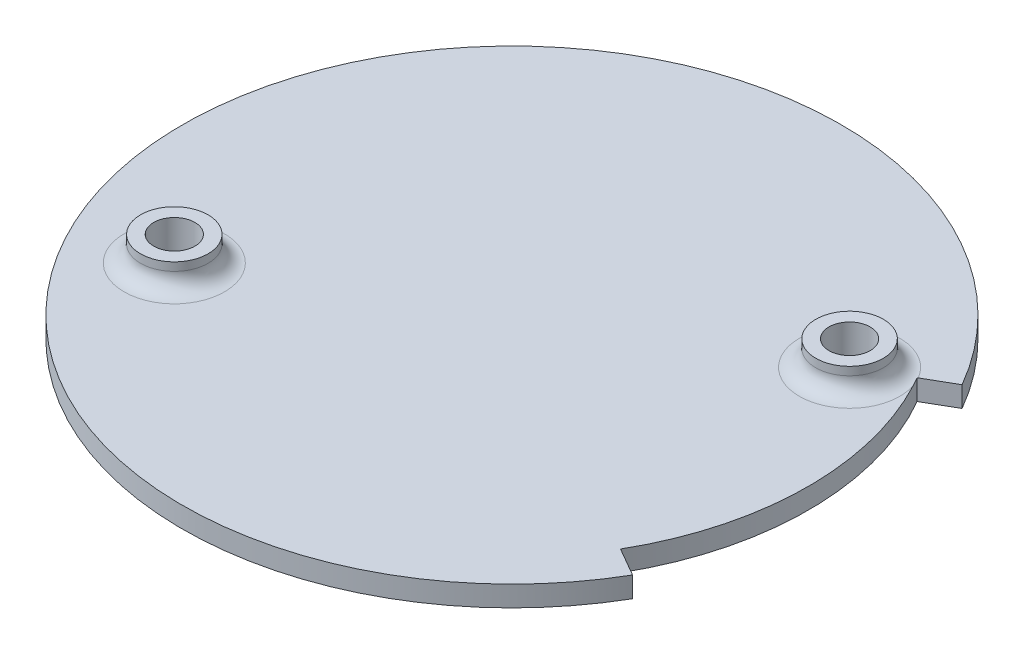
ISO-10303-21;
HEADER;
FILE_DESCRIPTION(('STEP AP214'),'2;1');
FILE_NAME('part.step','',(''),(''),'','','');
FILE_SCHEMA(('AUTOMOTIVE_DESIGN { 1 0 10303 214 1 1 1 1 }'));
ENDSEC;
DATA;
#1=APPLICATION_CONTEXT('core data for automotive mechanical design processes');
#2=APPLICATION_PROTOCOL_DEFINITION('international standard','automotive_design',2000,#1);
#3=PRODUCT_CONTEXT('',#1,'mechanical');
#4=PRODUCT('Part','Part','',(#3));
#5=PRODUCT_RELATED_PRODUCT_CATEGORY('part','',(#4));
#6=PRODUCT_DEFINITION_FORMATION('','',#4);
#7=PRODUCT_DEFINITION_CONTEXT('part definition',#1,'design');
#8=PRODUCT_DEFINITION('design','',#6,#7);
#9=PRODUCT_DEFINITION_SHAPE('','',#8);
#10=(LENGTH_UNIT() NAMED_UNIT(*) SI_UNIT(.MILLI.,.METRE.));
#11=(NAMED_UNIT(*) PLANE_ANGLE_UNIT() SI_UNIT($,.RADIAN.));
#12=(NAMED_UNIT(*) SI_UNIT($,.STERADIAN.) SOLID_ANGLE_UNIT());
#13=UNCERTAINTY_MEASURE_WITH_UNIT(LENGTH_MEASURE(1.E-05),#10,'distance_accuracy_value','');
#14=(GEOMETRIC_REPRESENTATION_CONTEXT(3) GLOBAL_UNCERTAINTY_ASSIGNED_CONTEXT((#13)) GLOBAL_UNIT_ASSIGNED_CONTEXT((#10,
#11,#12)) REPRESENTATION_CONTEXT('',''));
#15=CARTESIAN_POINT('',(0.,0.,0.));
#16=DIRECTION('',(0.,0.,1.));
#17=DIRECTION('',(1.,0.,0.));
#18=AXIS2_PLACEMENT_3D('',#15,#16,#17);
#19=CARTESIAN_POINT('',(0.,15.875,0.));
#20=DIRECTION('',(0.,1.,0.));
#21=DIRECTION('',(0.,0.,1.));
#22=AXIS2_PLACEMENT_3D('',#19,#20,#21);
#23=PLANE('',#22);
#24=CARTESIAN_POINT('',(-32.9955678841872,15.875,19.0499999999999));
#25=DIRECTION('',(0.,-1.,0.));
#26=DIRECTION('',(0.,0.,-1.));
#27=AXIS2_PLACEMENT_3D('',#24,#25,#26);
#28=CIRCLE('',#27,1.65);
#29=CARTESIAN_POINT('',(-32.9955678841872,15.875,17.3999999999999));
#30=VERTEX_POINT('',#29);
#31=EDGE_CURVE('E258',#30,#30,#28,.T.);
#32=ORIENTED_EDGE('',*,*,#31,.F.);
#33=EDGE_LOOP('',(#32));
#34=FACE_BOUND('',#33,.T.);
#35=CARTESIAN_POINT('',(32.9955678841872,15.875,-19.0499999999999));
#36=DIRECTION('',(0.,-1.,0.));
#37=DIRECTION('',(0.,0.,-1.));
#38=AXIS2_PLACEMENT_3D('',#35,#36,#37);
#39=CIRCLE('',#38,1.65);
#40=CARTESIAN_POINT('',(32.9955678841872,15.875,-20.6999999999999));
#41=VERTEX_POINT('',#40);
#42=EDGE_CURVE('E255',#41,#41,#39,.T.);
#43=ORIENTED_EDGE('',*,*,#42,.F.);
#44=EDGE_LOOP('',(#43));
#45=FACE_BOUND('',#44,.T.);
#46=DIRECTION('',(-0.866025403784438,0.,0.500000000000001));
#47=VECTOR('',#46,1.);
#48=CARTESIAN_POINT('',(0.,15.875,0.));
#49=LINE('',#48,#47);
#50=CARTESIAN_POINT('',(43.9940905122494,15.875,-25.4000000000001));
#51=VERTEX_POINT('',#50);
#52=CARTESIAN_POINT('',(39.5946814610245,15.875,-22.86));
#53=VERTEX_POINT('',#52);
#54=EDGE_CURVE('E92',#51,#53,#49,.T.);
#55=ORIENTED_EDGE('',*,*,#54,.T.);
#56=CARTESIAN_POINT('',(0.,15.875,0.));
#57=DIRECTION('',(0.,1.,0.));
#58=DIRECTION('',(0.,0.,1.));
#59=AXIS2_PLACEMENT_3D('',#56,#57,#58);
#60=CIRCLE('',#59,45.72);
#61=CARTESIAN_POINT('',(39.5946814610245,15.875,22.86));
#62=VERTEX_POINT('',#61);
#63=EDGE_CURVE('E93',#53,#62,#60,.F.);
#64=ORIENTED_EDGE('',*,*,#63,.T.);
#65=DIRECTION('',(-0.866025403784438,0.,-0.500000000000001));
#66=VECTOR('',#65,1.);
#67=CARTESIAN_POINT('',(0.,15.875,0.));
#68=LINE('',#67,#66);
#69=CARTESIAN_POINT('',(43.9940905122494,15.875,25.4000000000001));
#70=VERTEX_POINT('',#69);
#71=EDGE_CURVE('E106',#70,#62,#68,.T.);
#72=ORIENTED_EDGE('',*,*,#71,.F.);
#73=CARTESIAN_POINT('',(0.,15.875,0.));
#74=DIRECTION('',(0.,1.,0.));
#75=DIRECTION('',(0.,0.,1.));
#76=AXIS2_PLACEMENT_3D('',#73,#74,#75);
#77=CIRCLE('',#76,50.8);
#78=EDGE_CURVE('E96',#51,#70,#77,.T.);
#79=ORIENTED_EDGE('',*,*,#78,.F.);
#80=EDGE_LOOP('',(#55,#64,#72,#79));
#81=FACE_BOUND('',#80,.T.);
#82=ADVANCED_FACE('F41',(#34,#45,#81),#23,.F.);
#83=CARTESIAN_POINT('',(0.,3.175,0.));
#84=DIRECTION('',(0.,-1.,0.));
#85=DIRECTION('',(0.,0.,-1.));
#86=AXIS2_PLACEMENT_3D('',#83,#84,#85);
#87=CYLINDRICAL_SURFACE('',#86,50.8);
#88=DIRECTION('',(0.,1.,0.));
#89=VECTOR('',#88,1.);
#90=CARTESIAN_POINT('',(43.9940905122494,0.,-25.4000000000001));
#91=LINE('',#90,#89);
#92=CARTESIAN_POINT('',(43.9940905122494,19.05,-25.4000000000001));
#93=VERTEX_POINT('',#92);
#94=EDGE_CURVE('E110',#51,#93,#91,.T.);
#95=ORIENTED_EDGE('',*,*,#94,.F.);
#96=ORIENTED_EDGE('',*,*,#78,.T.);
#97=DIRECTION('',(0.,1.,0.));
#98=VECTOR('',#97,1.);
#99=CARTESIAN_POINT('',(43.9940905122494,0.,25.4000000000001));
#100=LINE('',#99,#98);
#101=CARTESIAN_POINT('',(43.9940905122494,19.05,25.4000000000001));
#102=VERTEX_POINT('',#101);
#103=EDGE_CURVE('E114',#70,#102,#100,.T.);
#104=ORIENTED_EDGE('',*,*,#103,.T.);
#105=CARTESIAN_POINT('',(0.,19.05,0.));
#106=DIRECTION('',(0.,1.,0.));
#107=DIRECTION('',(0.,0.,1.));
#108=AXIS2_PLACEMENT_3D('',#105,#106,#107);
#109=CIRCLE('',#108,50.8);
#110=EDGE_CURVE('E180',#93,#102,#109,.T.);
#111=ORIENTED_EDGE('',*,*,#110,.F.);
#112=EDGE_LOOP('',(#95,#96,#104,#111));
#113=FACE_BOUND('',#112,.T.);
#114=ADVANCED_FACE('F148',(#113),#87,.T.);
#115=CARTESIAN_POINT('',(0.,0.,0.));
#116=DIRECTION('',(-0.500000000000001,0.,0.866025403784438));
#117=DIRECTION('',(0.866025403784438,0.,0.500000000000001));
#118=AXIS2_PLACEMENT_3D('',#115,#116,#117);
#119=PLANE('',#118);
#120=ORIENTED_EDGE('',*,*,#103,.F.);
#121=ORIENTED_EDGE('',*,*,#71,.T.);
#122=DIRECTION('',(0.,1.,0.));
#123=VECTOR('',#122,1.);
#124=CARTESIAN_POINT('',(39.5946814610245,0.,22.86));
#125=LINE('',#124,#123);
#126=CARTESIAN_POINT('',(39.5946814610245,19.05,22.86));
#127=VERTEX_POINT('',#126);
#128=EDGE_CURVE('E105',#62,#127,#125,.T.);
#129=ORIENTED_EDGE('',*,*,#128,.T.);
#130=DIRECTION('',(-0.866025403784438,0.,-0.500000000000001));
#131=VECTOR('',#130,1.);
#132=CARTESIAN_POINT('',(0.,19.05,0.));
#133=LINE('',#132,#131);
#134=EDGE_CURVE('E177',#102,#127,#133,.T.);
#135=ORIENTED_EDGE('',*,*,#134,.F.);
#136=EDGE_LOOP('',(#120,#121,#129,#135));
#137=FACE_BOUND('',#136,.T.);
#138=ADVANCED_FACE('F155',(#137),#119,.F.);
#139=CARTESIAN_POINT('',(0.,0.,0.));
#140=DIRECTION('',(0.,1.,0.));
#141=DIRECTION('',(0.,0.,1.));
#142=AXIS2_PLACEMENT_3D('',#139,#140,#141);
#143=CYLINDRICAL_SURFACE('',#142,45.72);
#144=ORIENTED_EDGE('',*,*,#63,.F.);
#145=DIRECTION('',(0.,1.,0.));
#146=VECTOR('',#145,1.);
#147=CARTESIAN_POINT('',(39.5946814610245,0.,-22.8600000000001));
#148=LINE('',#147,#146);
#149=CARTESIAN_POINT('',(39.5946814610245,19.0531769868593,-22.8600000000001));
#150=VERTEX_POINT('',#149);
#151=EDGE_CURVE('E60',#53,#150,#148,.T.);
#152=ORIENTED_EDGE('',*,*,#151,.T.);
#153=CARTESIAN_POINT('',(39.5946814610245,19.0531769868593,-22.8600000000001));
#154=CARTESIAN_POINT('',(39.6584509865653,19.0531940198967,-22.7495479663954));
#155=CARTESIAN_POINT('',(39.7217581950967,19.0530434085188,-22.6388293044365));
#156=CARTESIAN_POINT('',(39.8474392470708,19.0525347988836,-22.4168742014402));
#157=CARTESIAN_POINT('',(39.9098131557882,19.0521768152002,-22.3056377973336));
#158=CARTESIAN_POINT('',(40.0336277838406,19.0513813297176,-22.0826472645168));
#159=CARTESIAN_POINT('',(40.0950685040283,19.0509438279912,-21.9708931362797));
#160=CARTESIAN_POINT('',(40.2170171736378,19.0502604060662,-21.746866345461));
#161=CARTESIAN_POINT('',(40.277525056747,19.0500144994265,-21.6345936467463));
#162=CARTESIAN_POINT('',(40.3375623533858,19.05,-21.5220692171247));
#163=B_SPLINE_CURVE_WITH_KNOTS('',3,(#153,#154,#155,#156,#157,#158,#159,#160,#161,#162),
.UNSPECIFIED.,.F.,.F.,(4,2,2,2,4),(0.,0.382615476870098,0.765204067465549,1.14779230850627,
1.53040762235897),.UNSPECIFIED.);
#164=CARTESIAN_POINT('',(40.3375623533858,19.05,-21.5220692171247));
#165=VERTEX_POINT('',#164);
#166=EDGE_CURVE('E11',#150,#165,#163,.T.);
#167=ORIENTED_EDGE('',*,*,#166,.T.);
#168=CARTESIAN_POINT('',(0.,19.05,0.));
#169=DIRECTION('',(0.,1.,0.));
#170=DIRECTION('',(0.,0.,1.));
#171=AXIS2_PLACEMENT_3D('',#168,#169,#170);
#172=CIRCLE('',#171,45.72);
#173=EDGE_CURVE('E186',#127,#165,#172,.T.);
#174=ORIENTED_EDGE('',*,*,#173,.F.);
#175=ORIENTED_EDGE('',*,*,#128,.F.);
#176=EDGE_LOOP('',(#144,#152,#167,#174,#175));
#177=FACE_BOUND('',#176,.T.);
#178=ADVANCED_FACE('F103',(#177),#143,.T.);
#179=CARTESIAN_POINT('',(0.,0.,0.));
#180=DIRECTION('',(0.500000000000001,0.,0.866025403784438));
#181=DIRECTION('',(0.866025403784438,0.,-0.500000000000001));
#182=AXIS2_PLACEMENT_3D('',#179,#180,#181);
#183=PLANE('',#182);
#184=ORIENTED_EDGE('',*,*,#54,.F.);
#185=ORIENTED_EDGE('',*,*,#94,.T.);
#186=DIRECTION('',(0.866025403784438,0.,-0.500000000000001));
#187=VECTOR('',#186,1.);
#188=CARTESIAN_POINT('',(0.,19.05,0.));
#189=LINE('',#188,#187);
#190=CARTESIAN_POINT('',(39.7046666873051,19.05,-22.9235000000001));
#191=VERTEX_POINT('',#190);
#192=EDGE_CURVE('E119',#191,#93,#189,.T.);
#193=ORIENTED_EDGE('',*,*,#192,.F.);
#194=CARTESIAN_POINT('',(39.7046666873052,21.59,-22.9234999999999));
#195=DIRECTION('',(0.500000000000001,0.,0.866025403784438));
#196=DIRECTION('',(0.866025403784438,0.,-0.500000000000001));
#197=AXIS2_PLACEMENT_3D('',#194,#195,#196);
#198=CIRCLE('',#197,2.54);
#199=EDGE_CURVE('E54',#191,#150,#198,.F.);
#200=ORIENTED_EDGE('',*,*,#199,.T.);
#201=ORIENTED_EDGE('',*,*,#151,.F.);
#202=EDGE_LOOP('',(#184,#185,#193,#200,#201));
#203=FACE_BOUND('',#202,.T.);
#204=ADVANCED_FACE('F108',(#203),#183,.T.);
#205=CARTESIAN_POINT('',(0.,19.05,0.));
#206=DIRECTION('',(0.,1.,0.));
#207=DIRECTION('',(0.,0.,1.));
#208=AXIS2_PLACEMENT_3D('',#205,#206,#207);
#209=PLANE('',#208);
#210=CARTESIAN_POINT('',(-32.9955678841872,19.05,19.0499999999999));
#211=DIRECTION('',(0.,1.,0.));
#212=DIRECTION('',(0.,0.,1.));
#213=AXIS2_PLACEMENT_3D('',#210,#211,#212);
#214=CIRCLE('',#213,7.747);
#215=CARTESIAN_POINT('',(-32.9955678841872,19.05,26.7969999999999));
#216=VERTEX_POINT('',#215);
#217=EDGE_CURVE('E122',#216,#216,#214,.F.);
#218=ORIENTED_EDGE('',*,*,#217,.T.);
#219=EDGE_LOOP('',(#218));
#220=FACE_BOUND('',#219,.T.);
#221=ORIENTED_EDGE('',*,*,#173,.T.);
#222=CARTESIAN_POINT('',(32.9955678841872,19.05,-19.0499999999999));
#223=DIRECTION('',(0.,1.,0.));
#224=DIRECTION('',(0.,0.,1.));
#225=AXIS2_PLACEMENT_3D('',#222,#223,#224);
#226=CIRCLE('',#225,7.747);
#227=EDGE_CURVE('E125',#165,#191,#226,.F.);
#228=ORIENTED_EDGE('',*,*,#227,.T.);
#229=ORIENTED_EDGE('',*,*,#192,.T.);
#230=ORIENTED_EDGE('',*,*,#110,.T.);
#231=ORIENTED_EDGE('',*,*,#134,.T.);
#232=EDGE_LOOP('',(#221,#228,#229,#230,#231));
#233=FACE_BOUND('',#232,.T.);
#234=ADVANCED_FACE('F161',(#220,#233),#209,.T.);
#235=CARTESIAN_POINT('',(32.9955678841872,17.78,-19.0499999999999));
#236=DIRECTION('',(0.,1.,0.));
#237=DIRECTION('',(0.,0.,1.));
#238=AXIS2_PLACEMENT_3D('',#235,#236,#237);
#239=PLANE('',#238);
#240=CARTESIAN_POINT('',(32.9955678841872,17.78,-19.0499999999999));
#241=DIRECTION('',(0.,1.,0.));
#242=DIRECTION('',(0.,0.,1.));
#243=AXIS2_PLACEMENT_3D('',#240,#241,#242);
#244=CIRCLE('',#243,1.65);
#245=CARTESIAN_POINT('',(32.9955678841872,17.78,-17.3999999999999));
#246=VERTEX_POINT('',#245);
#247=EDGE_CURVE('E253',#246,#246,#244,.F.);
#248=ORIENTED_EDGE('',*,*,#247,.T.);
#249=EDGE_LOOP('',(#248));
#250=FACE_BOUND('',#249,.T.);
#251=CARTESIAN_POINT('',(32.9955678841872,17.78,-19.0499999999999));
#252=DIRECTION('',(0.,1.,0.));
#253=DIRECTION('',(0.,0.,1.));
#254=AXIS2_PLACEMENT_3D('',#251,#252,#253);
#255=CIRCLE('',#254,3.175);
#256=CARTESIAN_POINT('',(32.9955678841872,17.78,-15.8749999999999));
#257=VERTEX_POINT('',#256);
#258=EDGE_CURVE('E214',#257,#257,#255,.T.);
#259=ORIENTED_EDGE('',*,*,#258,.T.);
#260=EDGE_LOOP('',(#259));
#261=FACE_BOUND('',#260,.T.);
#262=ADVANCED_FACE('F220',(#250,#261),#239,.T.);
#263=CARTESIAN_POINT('',(32.9955678841872,17.78,-19.0499999999999));
#264=DIRECTION('',(0.,1.,0.));
#265=DIRECTION('',(0.,0.,1.));
#266=AXIS2_PLACEMENT_3D('',#263,#264,#265);
#267=CYLINDRICAL_SURFACE('',#266,3.175);
#268=ORIENTED_EDGE('',*,*,#258,.F.);
#269=EDGE_LOOP('',(#268));
#270=FACE_BOUND('',#269,.T.);
#271=CARTESIAN_POINT('',(32.9955678841872,22.86,-19.0499999999999));
#272=DIRECTION('',(0.,1.,0.));
#273=DIRECTION('',(0.,0.,1.));
#274=AXIS2_PLACEMENT_3D('',#271,#272,#273);
#275=CIRCLE('',#274,3.175);
#276=CARTESIAN_POINT('',(32.9955678841872,22.86,-15.8749999999999));
#277=VERTEX_POINT('',#276);
#278=EDGE_CURVE('E202',#277,#277,#275,.F.);
#279=ORIENTED_EDGE('',*,*,#278,.F.);
#280=EDGE_LOOP('',(#279));
#281=FACE_BOUND('',#280,.T.);
#282=ADVANCED_FACE('F222',(#270,#281),#267,.F.);
#283=CARTESIAN_POINT('',(-32.9955678841872,17.78,19.0499999999999));
#284=DIRECTION('',(0.,1.,0.));
#285=DIRECTION('',(0.,0.,1.));
#286=AXIS2_PLACEMENT_3D('',#283,#284,#285);
#287=PLANE('',#286);
#288=CARTESIAN_POINT('',(-32.9955678841872,17.78,19.0499999999999));
#289=DIRECTION('',(0.,1.,0.));
#290=DIRECTION('',(0.,0.,1.));
#291=AXIS2_PLACEMENT_3D('',#288,#289,#290);
#292=CIRCLE('',#291,1.65);
#293=CARTESIAN_POINT('',(-32.9955678841872,17.78,20.6999999999999));
#294=VERTEX_POINT('',#293);
#295=EDGE_CURVE('E208',#294,#294,#292,.F.);
#296=ORIENTED_EDGE('',*,*,#295,.T.);
#297=EDGE_LOOP('',(#296));
#298=FACE_BOUND('',#297,.T.);
#299=CARTESIAN_POINT('',(-32.9955678841872,17.78,19.0499999999999));
#300=DIRECTION('',(0.,1.,0.));
#301=DIRECTION('',(0.,0.,1.));
#302=AXIS2_PLACEMENT_3D('',#299,#300,#301);
#303=CIRCLE('',#302,3.175);
#304=CARTESIAN_POINT('',(-32.9955678841872,17.78,22.2249999999999));
#305=VERTEX_POINT('',#304);
#306=EDGE_CURVE('E100',#305,#305,#303,.T.);
#307=ORIENTED_EDGE('',*,*,#306,.T.);
#308=EDGE_LOOP('',(#307));
#309=FACE_BOUND('',#308,.T.);
#310=ADVANCED_FACE('F225',(#298,#309),#287,.T.);
#311=CARTESIAN_POINT('',(-32.9955678841872,17.78,19.0499999999999));
#312=DIRECTION('',(0.,1.,0.));
#313=DIRECTION('',(0.,0.,1.));
#314=AXIS2_PLACEMENT_3D('',#311,#312,#313);
#315=CYLINDRICAL_SURFACE('',#314,3.175);
#316=ORIENTED_EDGE('',*,*,#306,.F.);
#317=EDGE_LOOP('',(#316));
#318=FACE_BOUND('',#317,.T.);
#319=CARTESIAN_POINT('',(-32.9955678841872,22.86,19.0499999999999));
#320=DIRECTION('',(0.,1.,0.));
#321=DIRECTION('',(0.,0.,1.));
#322=AXIS2_PLACEMENT_3D('',#319,#320,#321);
#323=CIRCLE('',#322,3.175);
#324=CARTESIAN_POINT('',(-32.9955678841872,22.86,22.2249999999999));
#325=VERTEX_POINT('',#324);
#326=EDGE_CURVE('E201',#325,#325,#323,.F.);
#327=ORIENTED_EDGE('',*,*,#326,.F.);
#328=EDGE_LOOP('',(#327));
#329=FACE_BOUND('',#328,.T.);
#330=ADVANCED_FACE('F240',(#318,#329),#315,.F.);
#331=CARTESIAN_POINT('',(-32.9955678841872,22.86,19.0499999999999));
#332=DIRECTION('',(0.,-1.,0.));
#333=DIRECTION('',(0.,0.,-1.));
#334=AXIS2_PLACEMENT_3D('',#331,#332,#333);
#335=CYLINDRICAL_SURFACE('',#334,5.207);
#336=CARTESIAN_POINT('',(-32.9955678841872,21.59,19.0499999999999));
#337=DIRECTION('',(0.,1.,0.));
#338=DIRECTION('',(0.,0.,1.));
#339=AXIS2_PLACEMENT_3D('',#336,#337,#338);
#340=CIRCLE('',#339,5.207);
#341=CARTESIAN_POINT('',(-32.9955678841872,21.59,13.8429999999999));
#342=VERTEX_POINT('',#341);
#343=EDGE_CURVE('E127',#342,#342,#340,.T.);
#344=CARTESIAN_POINT('',(-32.9955678841872,22.86,19.0499999999999));
#345=DIRECTION('',(0.,1.,0.));
#346=DIRECTION('',(0.,0.,1.));
#347=AXIS2_PLACEMENT_3D('',#344,#345,#346);
#348=CIRCLE('',#347,5.207);
#349=CARTESIAN_POINT('',(-32.9955678841872,22.86,13.8429999999999));
#350=VERTEX_POINT('',#349);
#351=EDGE_CURVE('E205',#350,#350,#348,.T.);
#352=CARTESIAN_POINT('',(-32.9955678841872,21.59,13.8429999999999));
#353=CARTESIAN_POINT('',(-32.9955678841872,21.6032291666667,13.8429999999999));
#354=CARTESIAN_POINT('',(-32.9955678841872,21.6164583333333,13.8429999999999));
#355=CARTESIAN_POINT('',(-32.9955678841872,21.6429166666667,13.8429999999999));
#356=CARTESIAN_POINT('',(-32.9955678841872,21.6561458333333,13.8429999999999));
#357=CARTESIAN_POINT('',(-32.9955678841872,21.6826041666667,13.8429999999999));
#358=CARTESIAN_POINT('',(-32.9955678841872,21.6958333333333,13.8429999999999));
#359=CARTESIAN_POINT('',(-32.9955678841872,21.7222916666667,13.8429999999999));
#360=CARTESIAN_POINT('',(-32.9955678841872,21.7355208333333,13.8429999999999));
#361=CARTESIAN_POINT('',(-32.9955678841872,21.7619791666667,13.8429999999999));
#362=CARTESIAN_POINT('',(-32.9955678841872,21.7752083333333,13.8429999999999));
#363=CARTESIAN_POINT('',(-32.9955678841872,21.8016666666667,13.8429999999999));
#364=CARTESIAN_POINT('',(-32.9955678841872,21.8148958333333,13.8429999999999));
#365=CARTESIAN_POINT('',(-32.9955678841872,21.8413541666667,13.8429999999999));
#366=CARTESIAN_POINT('',(-32.9955678841872,21.8545833333333,13.8429999999999));
#367=CARTESIAN_POINT('',(-32.9955678841872,21.8810416666667,13.8429999999999));
#368=CARTESIAN_POINT('',(-32.9955678841872,21.8942708333333,13.8429999999999));
#369=CARTESIAN_POINT('',(-32.9955678841872,21.9207291666667,13.8429999999999));
#370=CARTESIAN_POINT('',(-32.9955678841872,21.9339583333333,13.8429999999999));
#371=CARTESIAN_POINT('',(-32.9955678841872,21.9604166666667,13.8429999999999));
#372=CARTESIAN_POINT('',(-32.9955678841872,21.9736458333333,13.8429999999999));
#373=CARTESIAN_POINT('',(-32.9955678841872,22.0001041666667,13.8429999999999));
#374=CARTESIAN_POINT('',(-32.9955678841872,22.0133333333333,13.8429999999999));
#375=CARTESIAN_POINT('',(-32.9955678841872,22.0397916666667,13.8429999999999));
#376=CARTESIAN_POINT('',(-32.9955678841872,22.0530208333333,13.8429999999999));
#377=CARTESIAN_POINT('',(-32.9955678841872,22.0794791666667,13.8429999999999));
#378=CARTESIAN_POINT('',(-32.9955678841872,22.0927083333333,13.8429999999999));
#379=CARTESIAN_POINT('',(-32.9955678841872,22.1191666666667,13.8429999999999));
#380=CARTESIAN_POINT('',(-32.9955678841872,22.1323958333333,13.8429999999999));
#381=CARTESIAN_POINT('',(-32.9955678841872,22.1588541666667,13.8429999999999));
#382=CARTESIAN_POINT('',(-32.9955678841872,22.1720833333333,13.8429999999999));
#383=CARTESIAN_POINT('',(-32.9955678841872,22.1985416666667,13.8429999999999));
#384=CARTESIAN_POINT('',(-32.9955678841872,22.2117708333333,13.8429999999999));
#385=CARTESIAN_POINT('',(-32.9955678841872,22.2382291666667,13.8429999999999));
#386=CARTESIAN_POINT('',(-32.9955678841872,22.2514583333333,13.8429999999999));
#387=CARTESIAN_POINT('',(-32.9955678841872,22.2779166666667,13.8429999999999));
#388=CARTESIAN_POINT('',(-32.9955678841872,22.2911458333333,13.8429999999999));
#389=CARTESIAN_POINT('',(-32.9955678841872,22.3176041666667,13.8429999999999));
#390=CARTESIAN_POINT('',(-32.9955678841872,22.3308333333333,13.8429999999999));
#391=CARTESIAN_POINT('',(-32.9955678841872,22.3572916666667,13.8429999999999));
#392=CARTESIAN_POINT('',(-32.9955678841872,22.3705208333333,13.8429999999999));
#393=CARTESIAN_POINT('',(-32.9955678841872,22.3969791666667,13.8429999999999));
#394=CARTESIAN_POINT('',(-32.9955678841872,22.4102083333333,13.8429999999999));
#395=CARTESIAN_POINT('',(-32.9955678841872,22.4366666666667,13.8429999999999));
#396=CARTESIAN_POINT('',(-32.9955678841872,22.4498958333333,13.8429999999999));
#397=CARTESIAN_POINT('',(-32.9955678841872,22.4763541666667,13.8429999999999));
#398=CARTESIAN_POINT('',(-32.9955678841872,22.4895833333333,13.8429999999999));
#399=CARTESIAN_POINT('',(-32.9955678841872,22.5160416666667,13.8429999999999));
#400=CARTESIAN_POINT('',(-32.9955678841872,22.5292708333333,13.8429999999999));
#401=CARTESIAN_POINT('',(-32.9955678841872,22.5557291666667,13.8429999999999));
#402=CARTESIAN_POINT('',(-32.9955678841872,22.5689583333333,13.8429999999999));
#403=CARTESIAN_POINT('',(-32.9955678841872,22.5954166666667,13.8429999999999));
#404=CARTESIAN_POINT('',(-32.9955678841872,22.6086458333333,13.8429999999999));
#405=CARTESIAN_POINT('',(-32.9955678841872,22.6351041666667,13.8429999999999));
#406=CARTESIAN_POINT('',(-32.9955678841872,22.6483333333333,13.8429999999999));
#407=CARTESIAN_POINT('',(-32.9955678841872,22.6747916666667,13.8429999999999));
#408=CARTESIAN_POINT('',(-32.9955678841872,22.6880208333333,13.8429999999999));
#409=CARTESIAN_POINT('',(-32.9955678841872,22.7144791666667,13.8429999999999));
#410=CARTESIAN_POINT('',(-32.9955678841872,22.7277083333333,13.8429999999999));
#411=CARTESIAN_POINT('',(-32.9955678841872,22.7541666666667,13.8429999999999));
#412=CARTESIAN_POINT('',(-32.9955678841872,22.7673958333333,13.8429999999999));
#413=CARTESIAN_POINT('',(-32.9955678841872,22.7938541666667,13.8429999999999));
#414=CARTESIAN_POINT('',(-32.9955678841872,22.8070833333333,13.8429999999999));
#415=CARTESIAN_POINT('',(-32.9955678841872,22.8335416666667,13.8429999999999));
#416=CARTESIAN_POINT('',(-32.9955678841872,22.8467708333333,13.8429999999999));
#417=CARTESIAN_POINT('',(-32.9955678841872,22.86,13.8429999999999));
#418=B_SPLINE_CURVE_WITH_KNOTS('',3,(#352,#353,#354,#355,#356,#357,#358,#359,#360,#361,#362,
#363,#364,#365,#366,#367,#368,#369,#370,#371,#372,#373,#374,#375,#376,#377,#378,#379,#380,#381,
#382,#383,#384,#385,#386,#387,#388,#389,#390,#391,#392,#393,#394,#395,#396,#397,#398,#399,#400,
#401,#402,#403,#404,#405,#406,#407,#408,#409,#410,#411,#412,#413,#414,#415,#416,#417),
.UNSPECIFIED.,.F.,.F.,(4,2,2,2,2,2,2,2,2,2,2,2,2,2,2,2,2,2,2,2,2,2,2,2,2,2,2,2,2,2,2,2,4),(0.,
0.0396874999999998,0.0793749999999996,0.119062499999999,0.158749999999999,0.198437499999999,
0.238124999999999,0.277812499999999,0.317499999999998,0.357187499999998,0.396874999999998,
0.436562499999998,0.476249999999998,0.515937499999997,0.555624999999997,0.595312499999997,0.635,
0.6746875,0.714375,0.7540625,0.793749999999999,0.833437499999999,0.873124999999999,
0.912812499999999,0.952499999999998,0.992187499999998,1.031875,1.0715625,1.11125,1.1509375,
1.190625,1.2303125,1.27),.UNSPECIFIED.);
#419=EDGE_CURVE('BSEAM131',#342,#350,#418,.T.);
#420=ORIENTED_EDGE('',*,*,#343,.T.);
#421=ORIENTED_EDGE('',*,*,#351,.F.);
#422=ORIENTED_EDGE('',*,*,#419,.T.);
#423=ORIENTED_EDGE('',*,*,#419,.F.);
#424=EDGE_LOOP('',(#420,#422,#421,#423));
#425=FACE_BOUND('',#424,.T.);
#426=ADVANCED_FACE('F131',(#425),#335,.T.);
#427=CARTESIAN_POINT('',(0.,22.86,0.));
#428=DIRECTION('',(0.,1.,0.));
#429=DIRECTION('',(0.,0.,1.));
#430=AXIS2_PLACEMENT_3D('',#427,#428,#429);
#431=PLANE('',#430);
#432=ORIENTED_EDGE('',*,*,#326,.T.);
#433=EDGE_LOOP('',(#432));
#434=FACE_BOUND('',#433,.T.);
#435=ORIENTED_EDGE('',*,*,#351,.T.);
#436=EDGE_LOOP('',(#435));
#437=FACE_BOUND('',#436,.T.);
#438=ADVANCED_FACE('F195',(#434,#437),#431,.T.);
#439=CARTESIAN_POINT('',(32.9955678841872,22.86,-19.0499999999999));
#440=DIRECTION('',(0.,-1.,0.));
#441=DIRECTION('',(0.,0.,-1.));
#442=AXIS2_PLACEMENT_3D('',#439,#440,#441);
#443=CYLINDRICAL_SURFACE('',#442,5.207);
#444=CARTESIAN_POINT('',(32.9955678841872,21.59,-19.0499999999999));
#445=DIRECTION('',(0.,1.,0.));
#446=DIRECTION('',(0.,0.,1.));
#447=AXIS2_PLACEMENT_3D('',#444,#445,#446);
#448=CIRCLE('',#447,5.207);
#449=CARTESIAN_POINT('',(32.9955678841872,21.59,-24.2569999999999));
#450=VERTEX_POINT('',#449);
#451=EDGE_CURVE('E112',#450,#450,#448,.T.);
#452=CARTESIAN_POINT('',(32.9955678841872,22.86,-19.0499999999999));
#453=DIRECTION('',(0.,1.,0.));
#454=DIRECTION('',(0.,0.,1.));
#455=AXIS2_PLACEMENT_3D('',#452,#453,#454);
#456=CIRCLE('',#455,5.207);
#457=CARTESIAN_POINT('',(32.9955678841872,22.86,-24.2569999999999));
#458=VERTEX_POINT('',#457);
#459=EDGE_CURVE('E199',#458,#458,#456,.T.);
#460=CARTESIAN_POINT('',(32.9955678841872,21.59,-24.2569999999999));
#461=CARTESIAN_POINT('',(32.9955678841872,21.6032291666667,-24.2569999999999));
#462=CARTESIAN_POINT('',(32.9955678841872,21.6164583333333,-24.2569999999999));
#463=CARTESIAN_POINT('',(32.9955678841872,21.6429166666667,-24.2569999999999));
#464=CARTESIAN_POINT('',(32.9955678841872,21.6561458333333,-24.2569999999999));
#465=CARTESIAN_POINT('',(32.9955678841872,21.6826041666667,-24.2569999999999));
#466=CARTESIAN_POINT('',(32.9955678841872,21.6958333333333,-24.2569999999999));
#467=CARTESIAN_POINT('',(32.9955678841872,21.7222916666667,-24.2569999999999));
#468=CARTESIAN_POINT('',(32.9955678841872,21.7355208333333,-24.2569999999999));
#469=CARTESIAN_POINT('',(32.9955678841872,21.7619791666667,-24.2569999999999));
#470=CARTESIAN_POINT('',(32.9955678841872,21.7752083333333,-24.2569999999999));
#471=CARTESIAN_POINT('',(32.9955678841872,21.8016666666667,-24.2569999999999));
#472=CARTESIAN_POINT('',(32.9955678841872,21.8148958333333,-24.2569999999999));
#473=CARTESIAN_POINT('',(32.9955678841872,21.8413541666667,-24.2569999999999));
#474=CARTESIAN_POINT('',(32.9955678841872,21.8545833333333,-24.2569999999999));
#475=CARTESIAN_POINT('',(32.9955678841872,21.8810416666667,-24.2569999999999));
#476=CARTESIAN_POINT('',(32.9955678841872,21.8942708333333,-24.2569999999999));
#477=CARTESIAN_POINT('',(32.9955678841872,21.9207291666667,-24.2569999999999));
#478=CARTESIAN_POINT('',(32.9955678841872,21.9339583333333,-24.2569999999999));
#479=CARTESIAN_POINT('',(32.9955678841872,21.9604166666667,-24.2569999999999));
#480=CARTESIAN_POINT('',(32.9955678841872,21.9736458333333,-24.2569999999999));
#481=CARTESIAN_POINT('',(32.9955678841872,22.0001041666667,-24.2569999999999));
#482=CARTESIAN_POINT('',(32.9955678841872,22.0133333333333,-24.2569999999999));
#483=CARTESIAN_POINT('',(32.9955678841872,22.0397916666667,-24.2569999999999));
#484=CARTESIAN_POINT('',(32.9955678841872,22.0530208333333,-24.2569999999999));
#485=CARTESIAN_POINT('',(32.9955678841872,22.0794791666667,-24.2569999999999));
#486=CARTESIAN_POINT('',(32.9955678841872,22.0927083333333,-24.2569999999999));
#487=CARTESIAN_POINT('',(32.9955678841872,22.1191666666667,-24.2569999999999));
#488=CARTESIAN_POINT('',(32.9955678841872,22.1323958333333,-24.2569999999999));
#489=CARTESIAN_POINT('',(32.9955678841872,22.1588541666667,-24.2569999999999));
#490=CARTESIAN_POINT('',(32.9955678841872,22.1720833333333,-24.2569999999999));
#491=CARTESIAN_POINT('',(32.9955678841872,22.1985416666667,-24.2569999999999));
#492=CARTESIAN_POINT('',(32.9955678841872,22.2117708333333,-24.2569999999999));
#493=CARTESIAN_POINT('',(32.9955678841872,22.2382291666667,-24.2569999999999));
#494=CARTESIAN_POINT('',(32.9955678841872,22.2514583333333,-24.2569999999999));
#495=CARTESIAN_POINT('',(32.9955678841872,22.2779166666667,-24.2569999999999));
#496=CARTESIAN_POINT('',(32.9955678841872,22.2911458333333,-24.2569999999999));
#497=CARTESIAN_POINT('',(32.9955678841872,22.3176041666667,-24.2569999999999));
#498=CARTESIAN_POINT('',(32.9955678841872,22.3308333333333,-24.2569999999999));
#499=CARTESIAN_POINT('',(32.9955678841872,22.3572916666667,-24.2569999999999));
#500=CARTESIAN_POINT('',(32.9955678841872,22.3705208333333,-24.2569999999999));
#501=CARTESIAN_POINT('',(32.9955678841872,22.3969791666667,-24.2569999999999));
#502=CARTESIAN_POINT('',(32.9955678841872,22.4102083333333,-24.2569999999999));
#503=CARTESIAN_POINT('',(32.9955678841872,22.4366666666667,-24.2569999999999));
#504=CARTESIAN_POINT('',(32.9955678841872,22.4498958333333,-24.2569999999999));
#505=CARTESIAN_POINT('',(32.9955678841872,22.4763541666667,-24.2569999999999));
#506=CARTESIAN_POINT('',(32.9955678841872,22.4895833333333,-24.2569999999999));
#507=CARTESIAN_POINT('',(32.9955678841872,22.5160416666667,-24.2569999999999));
#508=CARTESIAN_POINT('',(32.9955678841872,22.5292708333333,-24.2569999999999));
#509=CARTESIAN_POINT('',(32.9955678841872,22.5557291666667,-24.2569999999999));
#510=CARTESIAN_POINT('',(32.9955678841872,22.5689583333333,-24.2569999999999));
#511=CARTESIAN_POINT('',(32.9955678841872,22.5954166666667,-24.2569999999999));
#512=CARTESIAN_POINT('',(32.9955678841872,22.6086458333333,-24.2569999999999));
#513=CARTESIAN_POINT('',(32.9955678841872,22.6351041666667,-24.2569999999999));
#514=CARTESIAN_POINT('',(32.9955678841872,22.6483333333333,-24.2569999999999));
#515=CARTESIAN_POINT('',(32.9955678841872,22.6747916666667,-24.2569999999999));
#516=CARTESIAN_POINT('',(32.9955678841872,22.6880208333333,-24.2569999999999));
#517=CARTESIAN_POINT('',(32.9955678841872,22.7144791666667,-24.2569999999999));
#518=CARTESIAN_POINT('',(32.9955678841872,22.7277083333333,-24.2569999999999));
#519=CARTESIAN_POINT('',(32.9955678841872,22.7541666666667,-24.2569999999999));
#520=CARTESIAN_POINT('',(32.9955678841872,22.7673958333333,-24.2569999999999));
#521=CARTESIAN_POINT('',(32.9955678841872,22.7938541666667,-24.2569999999999));
#522=CARTESIAN_POINT('',(32.9955678841872,22.8070833333333,-24.2569999999999));
#523=CARTESIAN_POINT('',(32.9955678841872,22.8335416666667,-24.2569999999999));
#524=CARTESIAN_POINT('',(32.9955678841872,22.8467708333333,-24.2569999999999));
#525=CARTESIAN_POINT('',(32.9955678841872,22.86,-24.2569999999999));
#526=B_SPLINE_CURVE_WITH_KNOTS('',3,(#460,#461,#462,#463,#464,#465,#466,#467,#468,#469,#470,
#471,#472,#473,#474,#475,#476,#477,#478,#479,#480,#481,#482,#483,#484,#485,#486,#487,#488,#489,
#490,#491,#492,#493,#494,#495,#496,#497,#498,#499,#500,#501,#502,#503,#504,#505,#506,#507,#508,
#509,#510,#511,#512,#513,#514,#515,#516,#517,#518,#519,#520,#521,#522,#523,#524,#525),
.UNSPECIFIED.,.F.,.F.,(4,2,2,2,2,2,2,2,2,2,2,2,2,2,2,2,2,2,2,2,2,2,2,2,2,2,2,2,2,2,2,2,4),(0.,
0.0396874999999998,0.0793749999999996,0.119062499999999,0.158749999999999,0.198437499999999,
0.238124999999999,0.277812499999999,0.317499999999998,0.357187499999998,0.396874999999998,
0.436562499999998,0.476249999999998,0.515937499999997,0.555624999999997,0.595312499999997,0.635,
0.6746875,0.714375,0.7540625,0.793749999999999,0.833437499999999,0.873124999999999,
0.912812499999999,0.952499999999998,0.992187499999998,1.031875,1.0715625,1.11125,1.1509375,
1.190625,1.2303125,1.27),.UNSPECIFIED.);
#527=EDGE_CURVE('BSEAM192',#450,#458,#526,.T.);
#528=ORIENTED_EDGE('',*,*,#451,.T.);
#529=ORIENTED_EDGE('',*,*,#459,.F.);
#530=ORIENTED_EDGE('',*,*,#527,.T.);
#531=ORIENTED_EDGE('',*,*,#527,.F.);
#532=EDGE_LOOP('',(#528,#530,#529,#531));
#533=FACE_BOUND('',#532,.T.);
#534=ADVANCED_FACE('F192',(#533),#443,.T.);
#535=CARTESIAN_POINT('',(0.,22.86,0.));
#536=DIRECTION('',(0.,1.,0.));
#537=DIRECTION('',(0.,0.,1.));
#538=AXIS2_PLACEMENT_3D('',#535,#536,#537);
#539=PLANE('',#538);
#540=ORIENTED_EDGE('',*,*,#278,.T.);
#541=EDGE_LOOP('',(#540));
#542=FACE_BOUND('',#541,.T.);
#543=ORIENTED_EDGE('',*,*,#459,.T.);
#544=EDGE_LOOP('',(#543));
#545=FACE_BOUND('',#544,.T.);
#546=ADVANCED_FACE('F145',(#542,#545),#539,.T.);
#547=CARTESIAN_POINT('',(32.9955678841872,21.59,-19.0499999999999));
#548=DIRECTION('',(0.,1.,0.));
#549=DIRECTION('',(0.,0.,1.));
#550=AXIS2_PLACEMENT_3D('',#547,#548,#549);
#551=TOROIDAL_SURFACE('',#550,7.747,2.54);
#552=ORIENTED_EDGE('',*,*,#199,.F.);
#553=ORIENTED_EDGE('',*,*,#227,.F.);
#554=ORIENTED_EDGE('',*,*,#166,.F.);
#555=EDGE_LOOP('',(#552,#553,#554));
#556=FACE_BOUND('',#555,.T.);
#557=ORIENTED_EDGE('',*,*,#451,.F.);
#558=EDGE_LOOP('',(#557));
#559=FACE_BOUND('',#558,.T.);
#560=ADVANCED_FACE('F136',(#556,#559),#551,.F.);
#561=CARTESIAN_POINT('',(-32.9955678841872,21.59,19.0499999999999));
#562=DIRECTION('',(0.,1.,0.));
#563=DIRECTION('',(0.,0.,1.));
#564=AXIS2_PLACEMENT_3D('',#561,#562,#563);
#565=TOROIDAL_SURFACE('',#564,7.747,2.54);
#566=ORIENTED_EDGE('',*,*,#217,.F.);
#567=EDGE_LOOP('',(#566));
#568=FACE_BOUND('',#567,.T.);
#569=ORIENTED_EDGE('',*,*,#343,.F.);
#570=EDGE_LOOP('',(#569));
#571=FACE_BOUND('',#570,.T.);
#572=ADVANCED_FACE('F43',(#568,#571),#565,.F.);
#573=CARTESIAN_POINT('',(-32.9955678841872,22.4469047558312,19.0499999999999));
#574=DIRECTION('',(0.,-1.,0.));
#575=DIRECTION('',(0.,0.,-1.));
#576=AXIS2_PLACEMENT_3D('',#573,#574,#575);
#577=CYLINDRICAL_SURFACE('',#576,1.65);
#578=ORIENTED_EDGE('',*,*,#31,.T.);
#579=EDGE_LOOP('',(#578));
#580=FACE_BOUND('',#579,.T.);
#581=ORIENTED_EDGE('',*,*,#295,.F.);
#582=EDGE_LOOP('',(#581));
#583=FACE_BOUND('',#582,.T.);
#584=ADVANCED_FACE('F135',(#580,#583),#577,.F.);
#585=CARTESIAN_POINT('',(32.9955678841872,22.4469047558312,-19.0499999999999));
#586=DIRECTION('',(0.,-1.,0.));
#587=DIRECTION('',(0.,0.,-1.));
#588=AXIS2_PLACEMENT_3D('',#585,#586,#587);
#589=CYLINDRICAL_SURFACE('',#588,1.65);
#590=ORIENTED_EDGE('',*,*,#42,.T.);
#591=EDGE_LOOP('',(#590));
#592=FACE_BOUND('',#591,.T.);
#593=ORIENTED_EDGE('',*,*,#247,.F.);
#594=EDGE_LOOP('',(#593));
#595=FACE_BOUND('',#594,.T.);
#596=ADVANCED_FACE('F142',(#592,#595),#589,.F.);
#597=CLOSED_SHELL('',(#82,#114,#138,#178,#204,#234,#262,#282,#310,#330,#426,#438,#534,#546,#560,
#572,#584,#596));
#598=MANIFOLD_SOLID_BREP('B2',#597);
#599=ADVANCED_BREP_SHAPE_REPRESENTATION('',(#18,#598),#14);
#600=SHAPE_DEFINITION_REPRESENTATION(#9,#599);
ENDSEC;
END-ISO-10303-21;
